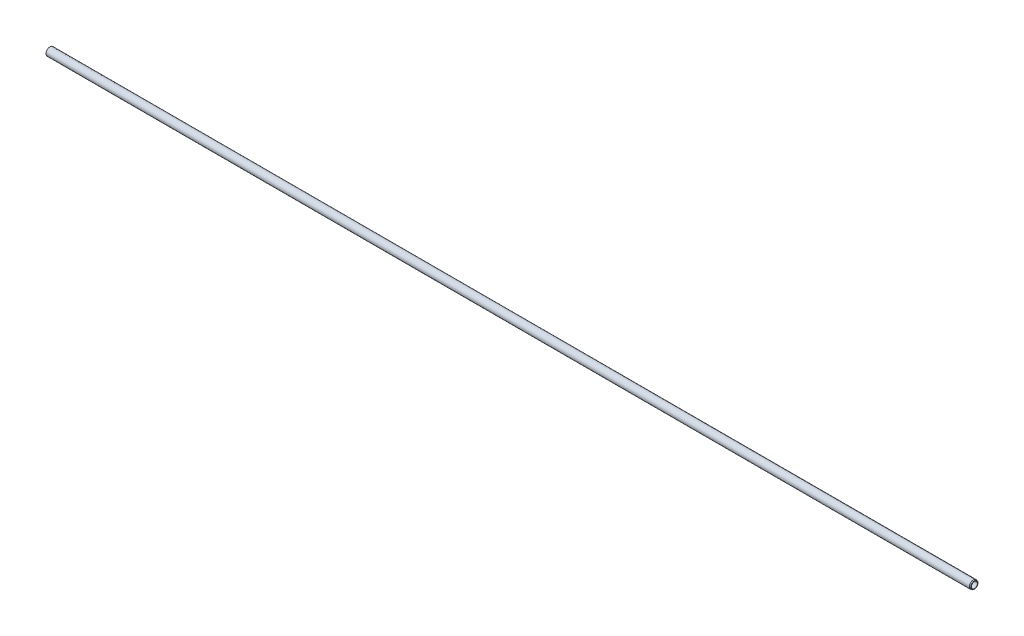
ISO-10303-21;
HEADER;
FILE_DESCRIPTION(('STEP AP214'),'2;1');
FILE_NAME('part.step','',(''),(''),'','','');
FILE_SCHEMA(('AUTOMOTIVE_DESIGN { 1 0 10303 214 1 1 1 1 }'));
ENDSEC;
DATA;
#1=APPLICATION_CONTEXT('core data for automotive mechanical design processes');
#2=APPLICATION_PROTOCOL_DEFINITION('international standard','automotive_design',2000,#1);
#3=PRODUCT_CONTEXT('',#1,'mechanical');
#4=PRODUCT('Part','Part','',(#3));
#5=PRODUCT_RELATED_PRODUCT_CATEGORY('part','',(#4));
#6=PRODUCT_DEFINITION_FORMATION('','',#4);
#7=PRODUCT_DEFINITION_CONTEXT('part definition',#1,'design');
#8=PRODUCT_DEFINITION('design','',#6,#7);
#9=PRODUCT_DEFINITION_SHAPE('','',#8);
#10=(LENGTH_UNIT() NAMED_UNIT(*) SI_UNIT(.MILLI.,.METRE.));
#11=(NAMED_UNIT(*) PLANE_ANGLE_UNIT() SI_UNIT($,.RADIAN.));
#12=(NAMED_UNIT(*) SI_UNIT($,.STERADIAN.) SOLID_ANGLE_UNIT());
#13=UNCERTAINTY_MEASURE_WITH_UNIT(LENGTH_MEASURE(1.E-05),#10,'distance_accuracy_value','');
#14=(GEOMETRIC_REPRESENTATION_CONTEXT(3) GLOBAL_UNCERTAINTY_ASSIGNED_CONTEXT((#13)) GLOBAL_UNIT_ASSIGNED_CONTEXT((#10,
#11,#12)) REPRESENTATION_CONTEXT('',''));
#15=CARTESIAN_POINT('',(0.,0.,0.));
#16=DIRECTION('',(0.,0.,1.));
#17=DIRECTION('',(1.,0.,0.));
#18=AXIS2_PLACEMENT_3D('',#15,#16,#17);
#19=CARTESIAN_POINT('',(0.,0.,0.));
#20=DIRECTION('',(-1.,0.,0.));
#21=DIRECTION('',(0.,0.,1.));
#22=AXIS2_PLACEMENT_3D('',#19,#20,#21);
#23=CYLINDRICAL_SURFACE('',#22,10.);
#24=CARTESIAN_POINT('',(2309.5,0.,0.));
#25=DIRECTION('',(-1.,0.,0.));
#26=DIRECTION('',(0.,0.,1.));
#27=AXIS2_PLACEMENT_3D('',#24,#25,#26);
#28=CIRCLE('',#27,10.);
#29=CARTESIAN_POINT('',(2309.5,0.,10.));
#30=VERTEX_POINT('',#29);
#31=EDGE_CURVE('E10',#30,#30,#28,.T.);
#32=ORIENTED_EDGE('',*,*,#31,.T.);
#33=EDGE_LOOP('',(#32));
#34=FACE_BOUND('',#33,.T.);
#35=CARTESIAN_POINT('',(0.,0.,0.));
#36=DIRECTION('',(-1.,0.,0.));
#37=DIRECTION('',(0.,0.,1.));
#38=AXIS2_PLACEMENT_3D('',#35,#36,#37);
#39=CIRCLE('',#38,10.);
#40=CARTESIAN_POINT('',(0.,0.,10.));
#41=VERTEX_POINT('',#40);
#42=EDGE_CURVE('E60',#41,#41,#39,.T.);
#43=ORIENTED_EDGE('',*,*,#42,.F.);
#44=EDGE_LOOP('',(#43));
#45=FACE_BOUND('',#44,.T.);
#46=ADVANCED_FACE('F41',(#34,#45),#23,.T.);
#47=CARTESIAN_POINT('',(2309.5,0.,0.));
#48=DIRECTION('',(-1.,0.,0.));
#49=DIRECTION('',(0.,0.,1.));
#50=AXIS2_PLACEMENT_3D('',#47,#48,#49);
#51=CONICAL_SURFACE('',#50,10.,0.349065850398867);
#52=CARTESIAN_POINT('',(2312.,0.,0.));
#53=DIRECTION('',(-1.,0.,0.));
#54=DIRECTION('',(0.,0.,1.));
#55=AXIS2_PLACEMENT_3D('',#52,#53,#54);
#56=CIRCLE('',#55,9.09007441433451);
#57=CARTESIAN_POINT('',(2312.,0.,9.09007441433451));
#58=VERTEX_POINT('',#57);
#59=EDGE_CURVE('E47',#58,#58,#56,.T.);
#60=ORIENTED_EDGE('',*,*,#59,.T.);
#61=EDGE_LOOP('',(#60));
#62=FACE_BOUND('',#61,.T.);
#63=ORIENTED_EDGE('',*,*,#31,.F.);
#64=EDGE_LOOP('',(#63));
#65=FACE_BOUND('',#64,.T.);
#66=ADVANCED_FACE('F67',(#62,#65),#51,.T.);
#67=CARTESIAN_POINT('',(2312.,9.09007441433451,0.));
#68=DIRECTION('',(1.,0.,0.));
#69=DIRECTION('',(0.,0.,-1.));
#70=AXIS2_PLACEMENT_3D('',#67,#68,#69);
#71=PLANE('',#70);
#72=CARTESIAN_POINT('',(2312.,0.,0.));
#73=DIRECTION('',(-1.,0.,0.));
#74=DIRECTION('',(0.,0.,1.));
#75=AXIS2_PLACEMENT_3D('',#72,#73,#74);
#76=CIRCLE('',#75,7.5);
#77=CARTESIAN_POINT('',(2312.,0.,7.5));
#78=VERTEX_POINT('',#77);
#79=EDGE_CURVE('E51',#78,#78,#76,.T.);
#80=ORIENTED_EDGE('',*,*,#79,.T.);
#81=EDGE_LOOP('',(#80));
#82=FACE_BOUND('',#81,.T.);
#83=ORIENTED_EDGE('',*,*,#59,.F.);
#84=EDGE_LOOP('',(#83));
#85=FACE_BOUND('',#84,.T.);
#86=ADVANCED_FACE('F71',(#82,#85),#71,.T.);
#87=CARTESIAN_POINT('',(0.,0.,0.));
#88=DIRECTION('',(-1.,0.,0.));
#89=DIRECTION('',(0.,0.,1.));
#90=AXIS2_PLACEMENT_3D('',#87,#88,#89);
#91=CYLINDRICAL_SURFACE('',#90,7.5);
#92=ORIENTED_EDGE('',*,*,#79,.F.);
#93=EDGE_LOOP('',(#92));
#94=FACE_BOUND('',#93,.T.);
#95=CARTESIAN_POINT('',(0.,0.,0.));
#96=DIRECTION('',(-1.,0.,0.));
#97=DIRECTION('',(0.,0.,1.));
#98=AXIS2_PLACEMENT_3D('',#95,#96,#97);
#99=CIRCLE('',#98,7.5);
#100=CARTESIAN_POINT('',(0.,0.,7.5));
#101=VERTEX_POINT('',#100);
#102=EDGE_CURVE('E55',#101,#101,#99,.T.);
#103=ORIENTED_EDGE('',*,*,#102,.T.);
#104=EDGE_LOOP('',(#103));
#105=FACE_BOUND('',#104,.T.);
#106=ADVANCED_FACE('F75',(#94,#105),#91,.F.);
#107=CARTESIAN_POINT('',(0.,10.,0.));
#108=DIRECTION('',(1.,0.,0.));
#109=DIRECTION('',(0.,0.,-1.));
#110=AXIS2_PLACEMENT_3D('',#107,#108,#109);
#111=PLANE('',#110);
#112=ORIENTED_EDGE('',*,*,#102,.F.);
#113=EDGE_LOOP('',(#112));
#114=FACE_BOUND('',#113,.T.);
#115=ORIENTED_EDGE('',*,*,#42,.T.);
#116=EDGE_LOOP('',(#115));
#117=FACE_BOUND('',#116,.T.);
#118=ADVANCED_FACE('F64',(#114,#117),#111,.F.);
#119=CLOSED_SHELL('',(#46,#66,#86,#106,#118));
#120=MANIFOLD_SOLID_BREP('B2',#119);
#121=ADVANCED_BREP_SHAPE_REPRESENTATION('',(#18,#120),#14);
#122=SHAPE_DEFINITION_REPRESENTATION(#9,#121);
ENDSEC;
END-ISO-10303-21;
